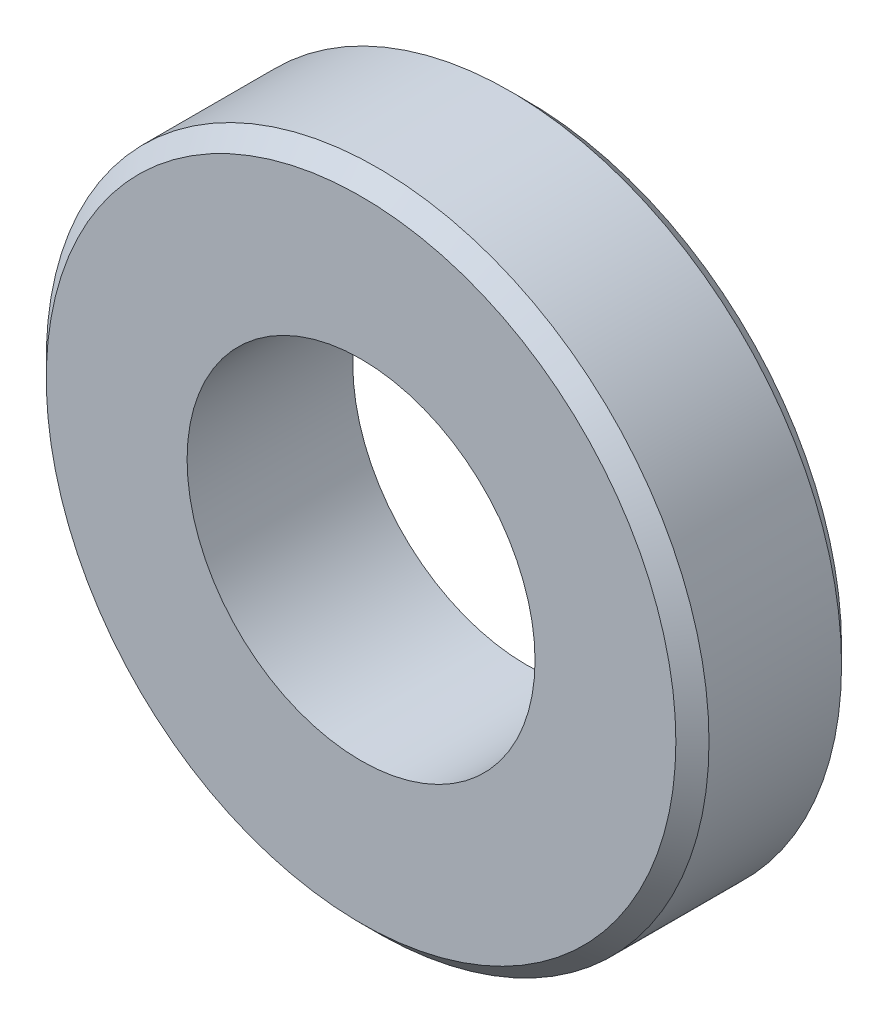
ISO-10303-21;
HEADER;
FILE_DESCRIPTION(('STEP AP214'),'2;1');
FILE_NAME('part.step','',(''),(''),'','','');
FILE_SCHEMA(('AUTOMOTIVE_DESIGN { 1 0 10303 214 1 1 1 1 }'));
ENDSEC;
DATA;
#1=APPLICATION_CONTEXT('core data for automotive mechanical design processes');
#2=APPLICATION_PROTOCOL_DEFINITION('international standard','automotive_design',2000,#1);
#3=PRODUCT_CONTEXT('',#1,'mechanical');
#4=PRODUCT('Part','Part','',(#3));
#5=PRODUCT_RELATED_PRODUCT_CATEGORY('part','',(#4));
#6=PRODUCT_DEFINITION_FORMATION('','',#4);
#7=PRODUCT_DEFINITION_CONTEXT('part definition',#1,'design');
#8=PRODUCT_DEFINITION('design','',#6,#7);
#9=PRODUCT_DEFINITION_SHAPE('','',#8);
#10=(LENGTH_UNIT() NAMED_UNIT(*) SI_UNIT(.MILLI.,.METRE.));
#11=(NAMED_UNIT(*) PLANE_ANGLE_UNIT() SI_UNIT($,.RADIAN.));
#12=(NAMED_UNIT(*) SI_UNIT($,.STERADIAN.) SOLID_ANGLE_UNIT());
#13=UNCERTAINTY_MEASURE_WITH_UNIT(LENGTH_MEASURE(1.E-05),#10,'distance_accuracy_value','');
#14=(GEOMETRIC_REPRESENTATION_CONTEXT(3) GLOBAL_UNCERTAINTY_ASSIGNED_CONTEXT((#13)) GLOBAL_UNIT_ASSIGNED_CONTEXT((#10,
#11,#12)) REPRESENTATION_CONTEXT('',''));
#15=CARTESIAN_POINT('',(0.,0.,0.));
#16=DIRECTION('',(0.,0.,1.));
#17=DIRECTION('',(1.,0.,0.));
#18=AXIS2_PLACEMENT_3D('',#15,#16,#17);
#19=CARTESIAN_POINT('',(0.,0.,1.));
#20=DIRECTION('',(0.,0.,1.));
#21=DIRECTION('',(1.,0.,0.));
#22=AXIS2_PLACEMENT_3D('',#19,#20,#21);
#23=PLANE('',#22);
#24=CARTESIAN_POINT('',(0.,0.,1.));
#25=DIRECTION('',(0.,0.,1.));
#26=DIRECTION('',(1.,0.,0.));
#27=AXIS2_PLACEMENT_3D('',#24,#25,#26);
#28=CIRCLE('',#27,3.8);
#29=CARTESIAN_POINT('',(3.8,0.,1.));
#30=VERTEX_POINT('',#29);
#31=EDGE_CURVE('E10',#30,#30,#28,.T.);
#32=ORIENTED_EDGE('',*,*,#31,.T.);
#33=EDGE_LOOP('',(#32));
#34=FACE_BOUND('',#33,.T.);
#35=CARTESIAN_POINT('',(0.,0.,1.));
#36=DIRECTION('',(0.,0.,1.));
#37=DIRECTION('',(1.,0.,0.));
#38=AXIS2_PLACEMENT_3D('',#35,#36,#37);
#39=CIRCLE('',#38,2.1);
#40=CARTESIAN_POINT('',(2.1,0.,1.));
#41=VERTEX_POINT('',#40);
#42=EDGE_CURVE('E56',#41,#41,#39,.T.);
#43=ORIENTED_EDGE('',*,*,#42,.F.);
#44=EDGE_LOOP('',(#43));
#45=FACE_BOUND('',#44,.T.);
#46=ADVANCED_FACE('F35',(#34,#45),#23,.T.);
#47=CARTESIAN_POINT('',(0.,0.,-1.));
#48=DIRECTION('',(0.,0.,1.));
#49=DIRECTION('',(1.,0.,0.));
#50=AXIS2_PLACEMENT_3D('',#47,#48,#49);
#51=PLANE('',#50);
#52=CARTESIAN_POINT('',(0.,0.,-1.));
#53=DIRECTION('',(0.,0.,1.));
#54=DIRECTION('',(1.,0.,0.));
#55=AXIS2_PLACEMENT_3D('',#52,#53,#54);
#56=CIRCLE('',#55,3.8);
#57=CARTESIAN_POINT('',(3.8,0.,-1.));
#58=VERTEX_POINT('',#57);
#59=EDGE_CURVE('E43',#58,#58,#56,.F.);
#60=ORIENTED_EDGE('',*,*,#59,.T.);
#61=EDGE_LOOP('',(#60));
#62=FACE_BOUND('',#61,.T.);
#63=CARTESIAN_POINT('',(0.,0.,-1.));
#64=DIRECTION('',(0.,0.,1.));
#65=DIRECTION('',(1.,0.,0.));
#66=AXIS2_PLACEMENT_3D('',#63,#64,#65);
#67=CIRCLE('',#66,2.1);
#68=CARTESIAN_POINT('',(2.1,0.,-1.));
#69=VERTEX_POINT('',#68);
#70=EDGE_CURVE('E57',#69,#69,#67,.T.);
#71=ORIENTED_EDGE('',*,*,#70,.T.);
#72=EDGE_LOOP('',(#71));
#73=FACE_BOUND('',#72,.T.);
#74=ADVANCED_FACE('F67',(#62,#73),#51,.F.);
#75=CARTESIAN_POINT('',(0.,0.,1.));
#76=DIRECTION('',(0.,0.,-1.));
#77=DIRECTION('',(-1.,0.,0.));
#78=AXIS2_PLACEMENT_3D('',#75,#76,#77);
#79=CYLINDRICAL_SURFACE('',#78,4.);
#80=CARTESIAN_POINT('',(0.,0.,-0.799999999999999));
#81=DIRECTION('',(0.,0.,1.));
#82=DIRECTION('',(1.,0.,0.));
#83=AXIS2_PLACEMENT_3D('',#80,#81,#82);
#84=CIRCLE('',#83,4.);
#85=CARTESIAN_POINT('',(4.,0.,-0.799999999999999));
#86=VERTEX_POINT('',#85);
#87=EDGE_CURVE('E47',#86,#86,#84,.T.);
#88=ORIENTED_EDGE('',*,*,#87,.T.);
#89=EDGE_LOOP('',(#88));
#90=FACE_BOUND('',#89,.T.);
#91=CARTESIAN_POINT('',(0.,0.,0.799999999999999));
#92=DIRECTION('',(0.,0.,1.));
#93=DIRECTION('',(1.,0.,0.));
#94=AXIS2_PLACEMENT_3D('',#91,#92,#93);
#95=CIRCLE('',#94,4.);
#96=CARTESIAN_POINT('',(4.,0.,0.799999999999999));
#97=VERTEX_POINT('',#96);
#98=EDGE_CURVE('E51',#97,#97,#95,.F.);
#99=ORIENTED_EDGE('',*,*,#98,.T.);
#100=EDGE_LOOP('',(#99));
#101=FACE_BOUND('',#100,.T.);
#102=ADVANCED_FACE('F72',(#90,#101),#79,.T.);
#103=CARTESIAN_POINT('',(0.,0.,1.));
#104=DIRECTION('',(0.,0.,-1.));
#105=DIRECTION('',(-1.,0.,0.));
#106=AXIS2_PLACEMENT_3D('',#103,#104,#105);
#107=CYLINDRICAL_SURFACE('',#106,2.1);
#108=ORIENTED_EDGE('',*,*,#42,.T.);
#109=EDGE_LOOP('',(#108));
#110=FACE_BOUND('',#109,.T.);
#111=ORIENTED_EDGE('',*,*,#70,.F.);
#112=EDGE_LOOP('',(#111));
#113=FACE_BOUND('',#112,.T.);
#114=ADVANCED_FACE('F63',(#110,#113),#107,.F.);
#115=CARTESIAN_POINT('',(0.,0.,-0.799999999999999));
#116=DIRECTION('',(0.,0.,1.));
#117=DIRECTION('',(1.,0.,0.));
#118=AXIS2_PLACEMENT_3D('',#115,#116,#117);
#119=CONICAL_SURFACE('',#118,4.,0.785398163397453);
#120=ORIENTED_EDGE('',*,*,#59,.F.);
#121=EDGE_LOOP('',(#120));
#122=FACE_BOUND('',#121,.T.);
#123=ORIENTED_EDGE('',*,*,#87,.F.);
#124=EDGE_LOOP('',(#123));
#125=FACE_BOUND('',#124,.T.);
#126=ADVANCED_FACE('F79',(#122,#125),#119,.T.);
#127=CARTESIAN_POINT('',(0.,0.,1.));
#128=DIRECTION('',(0.,0.,-1.));
#129=DIRECTION('',(-1.,0.,0.));
#130=AXIS2_PLACEMENT_3D('',#127,#128,#129);
#131=CONICAL_SURFACE('',#130,3.8,0.785398163397444);
#132=ORIENTED_EDGE('',*,*,#98,.F.);
#133=EDGE_LOOP('',(#132));
#134=FACE_BOUND('',#133,.T.);
#135=ORIENTED_EDGE('',*,*,#31,.F.);
#136=EDGE_LOOP('',(#135));
#137=FACE_BOUND('',#136,.T.);
#138=ADVANCED_FACE('F38',(#134,#137),#131,.T.);
#139=CLOSED_SHELL('',(#46,#74,#102,#114,#126,#138));
#140=MANIFOLD_SOLID_BREP('B2',#139);
#141=ADVANCED_BREP_SHAPE_REPRESENTATION('',(#18,#140),#14);
#142=SHAPE_DEFINITION_REPRESENTATION(#9,#141);
ENDSEC;
END-ISO-10303-21;
